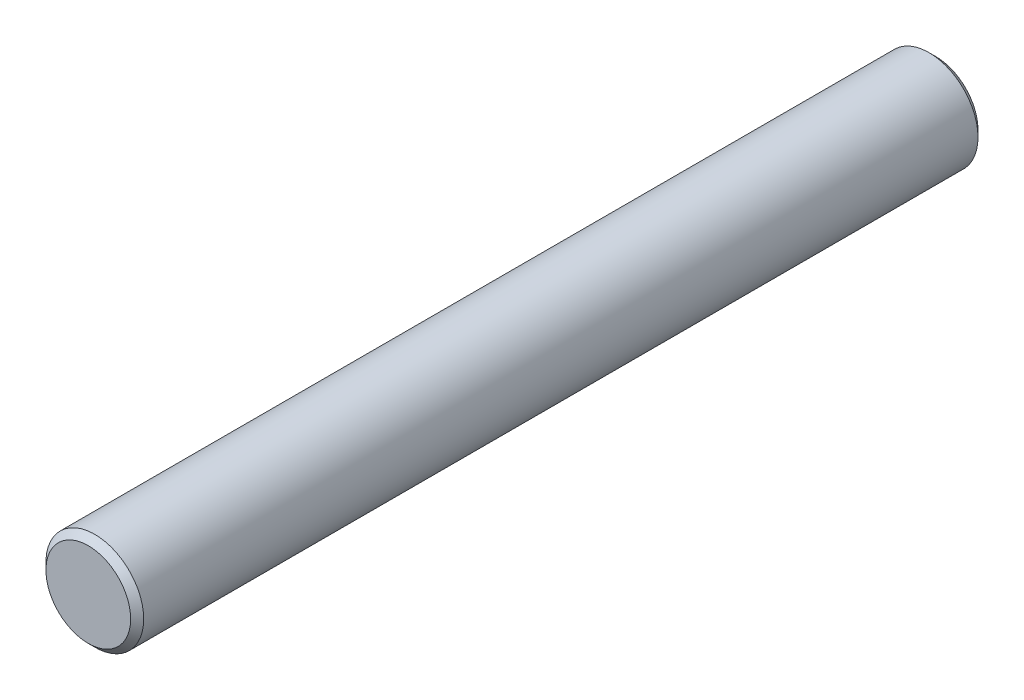
ISO-10303-21;
HEADER;
FILE_DESCRIPTION(('STEP AP214'),'2;1');
FILE_NAME('part.step','',(''),(''),'','','');
FILE_SCHEMA(('AUTOMOTIVE_DESIGN { 1 0 10303 214 1 1 1 1 }'));
ENDSEC;
DATA;
#1=APPLICATION_CONTEXT('core data for automotive mechanical design processes');
#2=APPLICATION_PROTOCOL_DEFINITION('international standard','automotive_design',2000,#1);
#3=PRODUCT_CONTEXT('',#1,'mechanical');
#4=PRODUCT('Part','Part','',(#3));
#5=PRODUCT_RELATED_PRODUCT_CATEGORY('part','',(#4));
#6=PRODUCT_DEFINITION_FORMATION('','',#4);
#7=PRODUCT_DEFINITION_CONTEXT('part definition',#1,'design');
#8=PRODUCT_DEFINITION('design','',#6,#7);
#9=PRODUCT_DEFINITION_SHAPE('','',#8);
#10=(LENGTH_UNIT() NAMED_UNIT(*) SI_UNIT(.MILLI.,.METRE.));
#11=(NAMED_UNIT(*) PLANE_ANGLE_UNIT() SI_UNIT($,.RADIAN.));
#12=(NAMED_UNIT(*) SI_UNIT($,.STERADIAN.) SOLID_ANGLE_UNIT());
#13=UNCERTAINTY_MEASURE_WITH_UNIT(LENGTH_MEASURE(1.E-05),#10,'distance_accuracy_value','');
#14=(GEOMETRIC_REPRESENTATION_CONTEXT(3) GLOBAL_UNCERTAINTY_ASSIGNED_CONTEXT((#13)) GLOBAL_UNIT_ASSIGNED_CONTEXT((#10,
#11,#12)) REPRESENTATION_CONTEXT('',''));
#15=CARTESIAN_POINT('',(0.,0.,0.));
#16=DIRECTION('',(0.,0.,1.));
#17=DIRECTION('',(1.,0.,0.));
#18=AXIS2_PLACEMENT_3D('',#15,#16,#17);
#19=CARTESIAN_POINT('',(0.,0.,13.));
#20=DIRECTION('',(0.,0.,-1.));
#21=DIRECTION('',(-1.,0.,0.));
#22=AXIS2_PLACEMENT_3D('',#19,#20,#21);
#23=CYLINDRICAL_SURFACE('',#22,0.75);
#24=CARTESIAN_POINT('',(0.,0.,0.100000000000013));
#25=DIRECTION('',(0.,0.,1.));
#26=DIRECTION('',(1.,0.,0.));
#27=AXIS2_PLACEMENT_3D('',#24,#25,#26);
#28=CIRCLE('',#27,0.75);
#29=CARTESIAN_POINT('',(0.75,0.,0.100000000000013));
#30=VERTEX_POINT('',#29);
#31=EDGE_CURVE('E53',#30,#30,#28,.T.);
#32=ORIENTED_EDGE('',*,*,#31,.T.);
#33=EDGE_LOOP('',(#32));
#34=FACE_BOUND('',#33,.T.);
#35=CARTESIAN_POINT('',(0.,0.,12.9));
#36=DIRECTION('',(0.,0.,1.));
#37=DIRECTION('',(1.,0.,0.));
#38=AXIS2_PLACEMENT_3D('',#35,#36,#37);
#39=CIRCLE('',#38,0.75);
#40=CARTESIAN_POINT('',(0.75,0.,12.9));
#41=VERTEX_POINT('',#40);
#42=EDGE_CURVE('E57',#41,#41,#39,.F.);
#43=ORIENTED_EDGE('',*,*,#42,.T.);
#44=EDGE_LOOP('',(#43));
#45=FACE_BOUND('',#44,.T.);
#46=ADVANCED_FACE('F42',(#34,#45),#23,.T.);
#47=CARTESIAN_POINT('',(0.,0.,13.));
#48=DIRECTION('',(0.,0.,1.));
#49=DIRECTION('',(1.,0.,0.));
#50=AXIS2_PLACEMENT_3D('',#47,#48,#49);
#51=PLANE('',#50);
#52=CARTESIAN_POINT('',(0.,0.,13.));
#53=DIRECTION('',(0.,0.,1.));
#54=DIRECTION('',(1.,0.,0.));
#55=AXIS2_PLACEMENT_3D('',#52,#53,#54);
#56=CIRCLE('',#55,0.650000000000008);
#57=CARTESIAN_POINT('',(0.650000000000008,0.,13.));
#58=VERTEX_POINT('',#57);
#59=EDGE_CURVE('E12',#58,#58,#56,.T.);
#60=ORIENTED_EDGE('',*,*,#59,.T.);
#61=EDGE_LOOP('',(#60));
#62=FACE_BOUND('',#61,.T.);
#63=ADVANCED_FACE('F73',(#62),#51,.T.);
#64=CARTESIAN_POINT('',(0.,0.,0.));
#65=DIRECTION('',(0.,0.,1.));
#66=DIRECTION('',(1.,0.,0.));
#67=AXIS2_PLACEMENT_3D('',#64,#65,#66);
#68=PLANE('',#67);
#69=CARTESIAN_POINT('',(0.,0.,0.));
#70=DIRECTION('',(0.,0.,1.));
#71=DIRECTION('',(1.,0.,0.));
#72=AXIS2_PLACEMENT_3D('',#69,#70,#71);
#73=CIRCLE('',#72,0.649999999999987);
#74=CARTESIAN_POINT('',(0.649999999999987,0.,0.));
#75=VERTEX_POINT('',#74);
#76=EDGE_CURVE('E49',#75,#75,#73,.F.);
#77=ORIENTED_EDGE('',*,*,#76,.T.);
#78=EDGE_LOOP('',(#77));
#79=FACE_BOUND('',#78,.T.);
#80=ADVANCED_FACE('F70',(#79),#68,.F.);
#81=CARTESIAN_POINT('',(0.,0.,0.100000000000013));
#82=DIRECTION('',(0.,0.,1.));
#83=DIRECTION('',(1.,0.,0.));
#84=AXIS2_PLACEMENT_3D('',#81,#82,#83);
#85=CONICAL_SURFACE('',#84,0.75,0.785398163397446);
#86=ORIENTED_EDGE('',*,*,#76,.F.);
#87=EDGE_LOOP('',(#86));
#88=FACE_BOUND('',#87,.T.);
#89=ORIENTED_EDGE('',*,*,#31,.F.);
#90=EDGE_LOOP('',(#89));
#91=FACE_BOUND('',#90,.T.);
#92=ADVANCED_FACE('F66',(#88,#91),#85,.T.);
#93=CARTESIAN_POINT('',(0.,0.,13.));
#94=DIRECTION('',(0.,0.,-1.));
#95=DIRECTION('',(-1.,0.,0.));
#96=AXIS2_PLACEMENT_3D('',#93,#94,#95);
#97=CONICAL_SURFACE('',#96,0.650000000000008,0.785398163397455);
#98=ORIENTED_EDGE('',*,*,#42,.F.);
#99=EDGE_LOOP('',(#98));
#100=FACE_BOUND('',#99,.T.);
#101=ORIENTED_EDGE('',*,*,#59,.F.);
#102=EDGE_LOOP('',(#101));
#103=FACE_BOUND('',#102,.T.);
#104=ADVANCED_FACE('F44',(#100,#103),#97,.T.);
#105=CLOSED_SHELL('',(#46,#63,#80,#92,#104));
#106=MANIFOLD_SOLID_BREP('B2',#105);
#107=ADVANCED_BREP_SHAPE_REPRESENTATION('',(#18,#106),#14);
#108=SHAPE_DEFINITION_REPRESENTATION(#9,#107);
ENDSEC;
END-ISO-10303-21;
